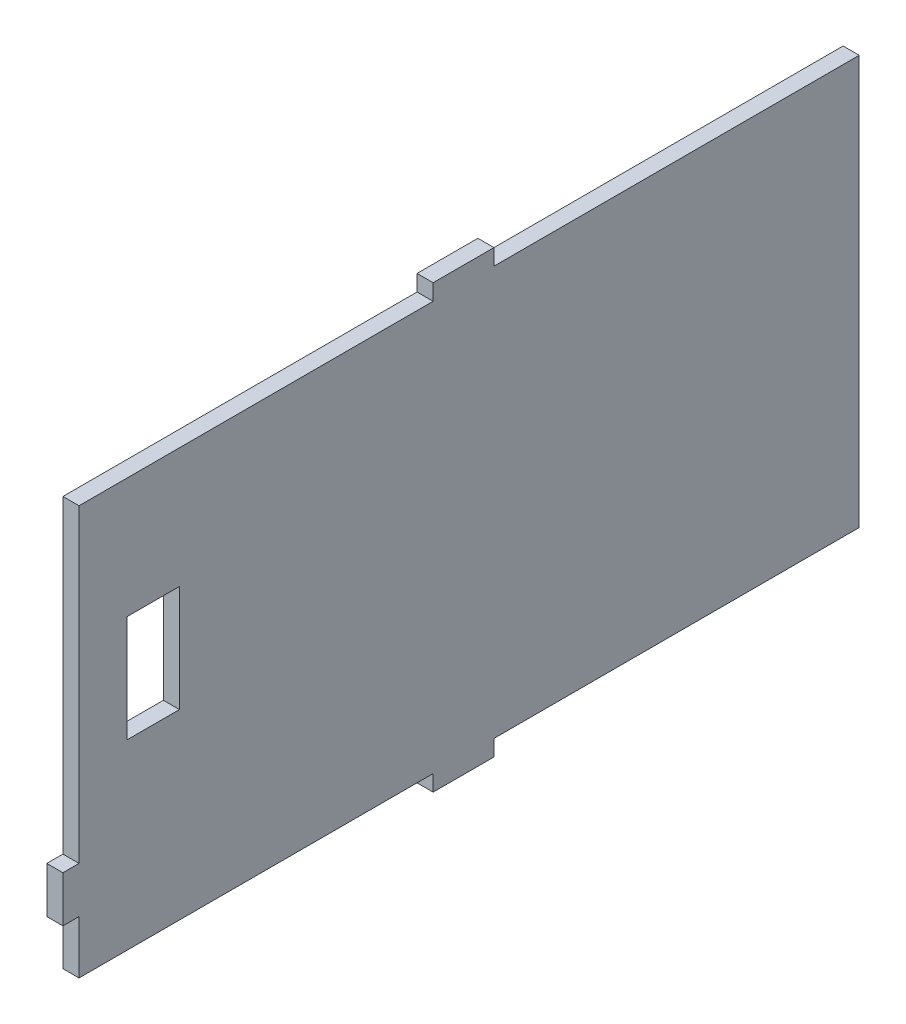
ISO-10303-21;
HEADER;
FILE_DESCRIPTION(('STEP AP214'),'2;1');
FILE_NAME('part.step','',(''),(''),'','','');
FILE_SCHEMA(('AUTOMOTIVE_DESIGN { 1 0 10303 214 1 1 1 1 }'));
ENDSEC;
DATA;
#1=APPLICATION_CONTEXT('core data for automotive mechanical design processes');
#2=APPLICATION_PROTOCOL_DEFINITION('international standard','automotive_design',2000,#1);
#3=PRODUCT_CONTEXT('',#1,'mechanical');
#4=PRODUCT('Part','Part','',(#3));
#5=PRODUCT_RELATED_PRODUCT_CATEGORY('part','',(#4));
#6=PRODUCT_DEFINITION_FORMATION('','',#4);
#7=PRODUCT_DEFINITION_CONTEXT('part definition',#1,'design');
#8=PRODUCT_DEFINITION('design','',#6,#7);
#9=PRODUCT_DEFINITION_SHAPE('','',#8);
#10=(LENGTH_UNIT() NAMED_UNIT(*) SI_UNIT(.MILLI.,.METRE.));
#11=(NAMED_UNIT(*) PLANE_ANGLE_UNIT() SI_UNIT($,.RADIAN.));
#12=(NAMED_UNIT(*) SI_UNIT($,.STERADIAN.) SOLID_ANGLE_UNIT());
#13=UNCERTAINTY_MEASURE_WITH_UNIT(LENGTH_MEASURE(1.E-05),#10,'distance_accuracy_value','');
#14=(GEOMETRIC_REPRESENTATION_CONTEXT(3) GLOBAL_UNCERTAINTY_ASSIGNED_CONTEXT((#13)) GLOBAL_UNIT_ASSIGNED_CONTEXT((#10,
#11,#12)) REPRESENTATION_CONTEXT('',''));
#15=CARTESIAN_POINT('',(0.,0.,0.));
#16=DIRECTION('',(0.,0.,1.));
#17=DIRECTION('',(1.,0.,0.));
#18=AXIS2_PLACEMENT_3D('',#15,#16,#17);
#19=CARTESIAN_POINT('',(-40.1734173991478,-2.50170936649234,90.8543847304114));
#20=DIRECTION('',(0.,0.,1.));
#21=DIRECTION('',(0.,1.,0.));
#22=AXIS2_PLACEMENT_3D('',#19,#20,#21);
#23=PLANE('',#22);
#24=DIRECTION('',(1.,0.,0.));
#25=VECTOR('',#24,1.);
#26=CARTESIAN_POINT('',(3.17500000000002,10.49,90.8543847304114));
#27=LINE('',#26,#25);
#28=CARTESIAN_POINT('',(0.,10.49,90.8543847304114));
#29=VERTEX_POINT('',#28);
#30=CARTESIAN_POINT('',(3.17500000000001,10.49,90.8543847304114));
#31=VERTEX_POINT('',#30);
#32=EDGE_CURVE('E203',#29,#31,#27,.T.);
#33=ORIENTED_EDGE('',*,*,#32,.F.);
#34=DIRECTION('',(0.,-1.,0.));
#35=VECTOR('',#34,1.);
#36=CARTESIAN_POINT('',(0.,80.65,90.8543847304114));
#37=LINE('',#36,#35);
#38=CARTESIAN_POINT('',(0.,0.,90.8543847304114));
#39=VERTEX_POINT('',#38);
#40=EDGE_CURVE('E218',#29,#39,#37,.T.);
#41=ORIENTED_EDGE('',*,*,#40,.T.);
#42=DIRECTION('',(1.,0.,0.));
#43=VECTOR('',#42,1.);
#44=CARTESIAN_POINT('',(3.17500000000001,0.,90.8543847304114));
#45=LINE('',#44,#43);
#46=CARTESIAN_POINT('',(3.17500000000002,0.,90.8543847304114));
#47=VERTEX_POINT('',#46);
#48=EDGE_CURVE('E229',#39,#47,#45,.T.);
#49=ORIENTED_EDGE('',*,*,#48,.T.);
#50=DIRECTION('',(0.,1.,0.));
#51=VECTOR('',#50,1.);
#52=CARTESIAN_POINT('',(3.17500000000001,80.65,90.8543847304114));
#53=LINE('',#52,#51);
#54=EDGE_CURVE('E302',#47,#31,#53,.T.);
#55=ORIENTED_EDGE('',*,*,#54,.T.);
#56=EDGE_LOOP('',(#33,#41,#49,#55));
#57=FACE_BOUND('',#56,.T.);
#58=ADVANCED_FACE('F33',(#57),#23,.T.);
#59=CARTESIAN_POINT('',(3.175,80.65,0.));
#60=DIRECTION('',(0.,-1.,0.));
#61=DIRECTION('',(0.,0.,-1.));
#62=AXIS2_PLACEMENT_3D('',#59,#60,#61);
#63=PLANE('',#62);
#64=DIRECTION('',(0.,0.,1.));
#65=VECTOR('',#64,1.);
#66=CARTESIAN_POINT('',(3.175,80.65,0.));
#67=LINE('',#66,#65);
#68=CARTESIAN_POINT('',(3.175,80.65,21.025));
#69=VERTEX_POINT('',#68);
#70=CARTESIAN_POINT('',(3.17500000000001,80.65,90.8543847304114));
#71=VERTEX_POINT('',#70);
#72=EDGE_CURVE('E300',#69,#71,#67,.T.);
#73=ORIENTED_EDGE('',*,*,#72,.F.);
#74=DIRECTION('',(-1.,0.,0.));
#75=VECTOR('',#74,1.);
#76=CARTESIAN_POINT('',(3.175,80.65,21.025));
#77=LINE('',#76,#75);
#78=CARTESIAN_POINT('',(0.,80.65,21.025));
#79=VERTEX_POINT('',#78);
#80=EDGE_CURVE('E333',#69,#79,#77,.T.);
#81=ORIENTED_EDGE('',*,*,#80,.T.);
#82=DIRECTION('',(0.,0.,1.));
#83=VECTOR('',#82,1.);
#84=CARTESIAN_POINT('',(0.,80.65,0.));
#85=LINE('',#84,#83);
#86=CARTESIAN_POINT('',(0.,80.65,90.8543847304114));
#87=VERTEX_POINT('',#86);
#88=EDGE_CURVE('E455',#79,#87,#85,.T.);
#89=ORIENTED_EDGE('',*,*,#88,.T.);
#90=DIRECTION('',(-1.,0.,0.));
#91=VECTOR('',#90,1.);
#92=CARTESIAN_POINT('',(3.17500000000001,80.65,90.8543847304114));
#93=LINE('',#92,#91);
#94=EDGE_CURVE('E316',#71,#87,#93,.T.);
#95=ORIENTED_EDGE('',*,*,#94,.F.);
#96=EDGE_LOOP('',(#73,#81,#89,#95));
#97=FACE_BOUND('',#96,.T.);
#98=ADVANCED_FACE('F266',(#97),#63,.F.);
#99=CARTESIAN_POINT('',(3.175,0.,0.));
#100=DIRECTION('',(1.,0.,0.));
#101=DIRECTION('',(0.,0.,-1.));
#102=AXIS2_PLACEMENT_3D('',#99,#100,#101);
#103=PLANE('',#102);
#104=DIRECTION('',(0.,1.,0.));
#105=VECTOR('',#104,1.);
#106=CARTESIAN_POINT('',(3.175,56.9724331353427,71.0409240772378));
#107=LINE('',#106,#105);
#108=CARTESIAN_POINT('',(3.175,35.936024987393,71.0409240772378));
#109=VERTEX_POINT('',#108);
#110=CARTESIAN_POINT('',(3.175,56.9724331353427,71.0409240772378));
#111=VERTEX_POINT('',#110);
#112=EDGE_CURVE('E48',#109,#111,#107,.T.);
#113=ORIENTED_EDGE('',*,*,#112,.F.);
#114=DIRECTION('',(0.,0.,-1.));
#115=VECTOR('',#114,1.);
#116=CARTESIAN_POINT('',(3.175,35.936024987393,71.0409240772378));
#117=LINE('',#116,#115);
#118=CARTESIAN_POINT('',(3.175,35.936024987393,81.3578620773683));
#119=VERTEX_POINT('',#118);
#120=EDGE_CURVE('E189',#119,#109,#117,.T.);
#121=ORIENTED_EDGE('',*,*,#120,.F.);
#122=DIRECTION('',(0.,-1.,0.));
#123=VECTOR('',#122,1.);
#124=CARTESIAN_POINT('',(3.175,56.9724331353427,81.3578620773683));
#125=LINE('',#124,#123);
#126=CARTESIAN_POINT('',(3.175,56.9724331353427,81.3578620773683));
#127=VERTEX_POINT('',#126);
#128=EDGE_CURVE('E173',#127,#119,#125,.T.);
#129=ORIENTED_EDGE('',*,*,#128,.F.);
#130=DIRECTION('',(0.,0.,1.));
#131=VECTOR('',#130,1.);
#132=CARTESIAN_POINT('',(3.175,56.9724331353427,71.0409240772378));
#133=LINE('',#132,#131);
#134=EDGE_CURVE('E182',#111,#127,#133,.T.);
#135=ORIENTED_EDGE('',*,*,#134,.F.);
#136=EDGE_LOOP('',(#113,#121,#129,#135));
#137=FACE_BOUND('',#136,.T.);
#138=ORIENTED_EDGE('',*,*,#54,.F.);
#139=DIRECTION('',(0.,0.,1.));
#140=VECTOR('',#139,1.);
#141=CARTESIAN_POINT('',(3.175,0.,0.));
#142=LINE('',#141,#140);
#143=CARTESIAN_POINT('',(3.175,0.,21.025));
#144=VERTEX_POINT('',#143);
#145=EDGE_CURVE('E388',#144,#47,#142,.T.);
#146=ORIENTED_EDGE('',*,*,#145,.F.);
#147=DIRECTION('',(0.,1.,0.));
#148=VECTOR('',#147,1.);
#149=CARTESIAN_POINT('',(3.175,-3.175,21.025));
#150=LINE('',#149,#148);
#151=CARTESIAN_POINT('',(3.175,-3.175,21.025));
#152=VERTEX_POINT('',#151);
#153=EDGE_CURVE('E393',#152,#144,#150,.T.);
#154=ORIENTED_EDGE('',*,*,#153,.F.);
#155=DIRECTION('',(0.,0.,1.));
#156=VECTOR('',#155,1.);
#157=CARTESIAN_POINT('',(3.175,-3.175,21.025));
#158=LINE('',#157,#156);
#159=CARTESIAN_POINT('',(3.175,-3.175,9.02500000000001));
#160=VERTEX_POINT('',#159);
#161=EDGE_CURVE('E374',#160,#152,#158,.T.);
#162=ORIENTED_EDGE('',*,*,#161,.F.);
#163=DIRECTION('',(0.,1.,0.));
#164=VECTOR('',#163,1.);
#165=CARTESIAN_POINT('',(3.175,-3.175,9.02500000000001));
#166=LINE('',#165,#164);
#167=CARTESIAN_POINT('',(3.175,0.,9.02500000000001));
#168=VERTEX_POINT('',#167);
#169=EDGE_CURVE('E364',#160,#168,#166,.T.);
#170=ORIENTED_EDGE('',*,*,#169,.T.);
#171=CARTESIAN_POINT('',(3.175,0.,-63.));
#172=VERTEX_POINT('',#171);
#173=EDGE_CURVE('E244',#172,#168,#142,.T.);
#174=ORIENTED_EDGE('',*,*,#173,.F.);
#175=DIRECTION('',(0.,-1.,0.));
#176=VECTOR('',#175,1.);
#177=CARTESIAN_POINT('',(3.175,80.65,-63.));
#178=LINE('',#177,#176);
#179=CARTESIAN_POINT('',(3.175,80.65,-63.));
#180=VERTEX_POINT('',#179);
#181=EDGE_CURVE('E428',#180,#172,#178,.T.);
#182=ORIENTED_EDGE('',*,*,#181,.F.);
#183=CARTESIAN_POINT('',(3.175,80.65,9.02500000000002));
#184=VERTEX_POINT('',#183);
#185=EDGE_CURVE('E354',#180,#184,#67,.T.);
#186=ORIENTED_EDGE('',*,*,#185,.T.);
#187=DIRECTION('',(0.,-1.,0.));
#188=VECTOR('',#187,1.);
#189=CARTESIAN_POINT('',(3.175,83.825,9.02500000000002));
#190=LINE('',#189,#188);
#191=CARTESIAN_POINT('',(3.175,83.825,9.02500000000002));
#192=VERTEX_POINT('',#191);
#193=EDGE_CURVE('E456',#192,#184,#190,.T.);
#194=ORIENTED_EDGE('',*,*,#193,.F.);
#195=DIRECTION('',(0.,0.,1.));
#196=VECTOR('',#195,1.);
#197=CARTESIAN_POINT('',(3.175,83.825,21.025));
#198=LINE('',#197,#196);
#199=CARTESIAN_POINT('',(3.175,83.825,21.025));
#200=VERTEX_POINT('',#199);
#201=EDGE_CURVE('E337',#192,#200,#198,.T.);
#202=ORIENTED_EDGE('',*,*,#201,.T.);
#203=DIRECTION('',(0.,-1.,0.));
#204=VECTOR('',#203,1.);
#205=CARTESIAN_POINT('',(3.175,83.825,21.025));
#206=LINE('',#205,#204);
#207=EDGE_CURVE('E329',#200,#69,#206,.T.);
#208=ORIENTED_EDGE('',*,*,#207,.T.);
#209=ORIENTED_EDGE('',*,*,#72,.T.);
#210=CARTESIAN_POINT('',(3.17500000000001,19.5727201275267,90.8543847304114));
#211=VERTEX_POINT('',#210);
#212=EDGE_CURVE('E291',#211,#71,#53,.T.);
#213=ORIENTED_EDGE('',*,*,#212,.F.);
#214=DIRECTION('',(0.,0.,-1.));
#215=VECTOR('',#214,1.);
#216=CARTESIAN_POINT('',(3.17500000000002,19.5727201275267,94.0343847304114));
#217=LINE('',#216,#215);
#218=CARTESIAN_POINT('',(3.17500000000002,19.5727201275267,94.0343847304114));
#219=VERTEX_POINT('',#218);
#220=EDGE_CURVE('E223',#219,#211,#217,.T.);
#221=ORIENTED_EDGE('',*,*,#220,.F.);
#222=DIRECTION('',(0.,1.,0.));
#223=VECTOR('',#222,1.);
#224=CARTESIAN_POINT('',(3.17500000000002,10.49,94.0343847304114));
#225=LINE('',#224,#223);
#226=CARTESIAN_POINT('',(3.17500000000002,10.49,94.0343847304114));
#227=VERTEX_POINT('',#226);
#228=EDGE_CURVE('E199',#227,#219,#225,.T.);
#229=ORIENTED_EDGE('',*,*,#228,.F.);
#230=DIRECTION('',(0.,0.,-1.));
#231=VECTOR('',#230,1.);
#232=CARTESIAN_POINT('',(3.17500000000002,10.49,94.0343847304114));
#233=LINE('',#232,#231);
#234=EDGE_CURVE('E209',#227,#31,#233,.T.);
#235=ORIENTED_EDGE('',*,*,#234,.T.);
#236=EDGE_LOOP('',(#138,#146,#154,#162,#170,#174,#182,#186,#194,#202,#208,#209,#213,#221,#229,#235));
#237=FACE_BOUND('',#236,.T.);
#238=ADVANCED_FACE('F186',(#137,#237),#103,.T.);
#239=CARTESIAN_POINT('',(0.,0.,0.));
#240=DIRECTION('',(1.,0.,0.));
#241=DIRECTION('',(0.,0.,-1.));
#242=AXIS2_PLACEMENT_3D('',#239,#240,#241);
#243=PLANE('',#242);
#244=DIRECTION('',(0.,0.,-1.));
#245=VECTOR('',#244,1.);
#246=CARTESIAN_POINT('',(0.,35.936024987393,0.));
#247=LINE('',#246,#245);
#248=CARTESIAN_POINT('',(0.,35.936024987393,81.3578620773683));
#249=VERTEX_POINT('',#248);
#250=CARTESIAN_POINT('',(0.,35.936024987393,71.0409240772378));
#251=VERTEX_POINT('',#250);
#252=EDGE_CURVE('E41',#249,#251,#247,.T.);
#253=ORIENTED_EDGE('',*,*,#252,.T.);
#254=DIRECTION('',(0.,1.,0.));
#255=VECTOR('',#254,1.);
#256=CARTESIAN_POINT('',(0.,0.,71.0409240772378));
#257=LINE('',#256,#255);
#258=CARTESIAN_POINT('',(0.,56.9724331353427,71.0409240772378));
#259=VERTEX_POINT('',#258);
#260=EDGE_CURVE('E11',#251,#259,#257,.T.);
#261=ORIENTED_EDGE('',*,*,#260,.T.);
#262=DIRECTION('',(0.,0.,1.));
#263=VECTOR('',#262,1.);
#264=CARTESIAN_POINT('',(0.,56.9724331353427,0.));
#265=LINE('',#264,#263);
#266=CARTESIAN_POINT('',(0.,56.9724331353427,81.3578620773683));
#267=VERTEX_POINT('',#266);
#268=EDGE_CURVE('E242',#259,#267,#265,.T.);
#269=ORIENTED_EDGE('',*,*,#268,.T.);
#270=DIRECTION('',(0.,-1.,0.));
#271=VECTOR('',#270,1.);
#272=CARTESIAN_POINT('',(0.,0.,81.3578620773683));
#273=LINE('',#272,#271);
#274=EDGE_CURVE('E176',#267,#249,#273,.T.);
#275=ORIENTED_EDGE('',*,*,#274,.T.);
#276=EDGE_LOOP('',(#253,#261,#269,#275));
#277=FACE_BOUND('',#276,.T.);
#278=DIRECTION('',(0.,0.,1.));
#279=VECTOR('',#278,1.);
#280=CARTESIAN_POINT('',(0.,0.,0.));
#281=LINE('',#280,#279);
#282=CARTESIAN_POINT('',(0.,0.,21.025));
#283=VERTEX_POINT('',#282);
#284=EDGE_CURVE('E314',#283,#39,#281,.T.);
#285=ORIENTED_EDGE('',*,*,#284,.T.);
#286=ORIENTED_EDGE('',*,*,#40,.F.);
#287=DIRECTION('',(0.,0.,-1.));
#288=VECTOR('',#287,1.);
#289=CARTESIAN_POINT('',(0.,10.49,94.0343847304114));
#290=LINE('',#289,#288);
#291=CARTESIAN_POINT('',(0.,10.49,94.0343847304114));
#292=VERTEX_POINT('',#291);
#293=EDGE_CURVE('E224',#292,#29,#290,.T.);
#294=ORIENTED_EDGE('',*,*,#293,.F.);
#295=DIRECTION('',(0.,-1.,0.));
#296=VECTOR('',#295,1.);
#297=CARTESIAN_POINT('',(0.,10.49,94.0343847304114));
#298=LINE('',#297,#296);
#299=CARTESIAN_POINT('',(0.,19.5727201275267,94.0343847304114));
#300=VERTEX_POINT('',#299);
#301=EDGE_CURVE('E205',#300,#292,#298,.T.);
#302=ORIENTED_EDGE('',*,*,#301,.F.);
#303=DIRECTION('',(0.,0.,-1.));
#304=VECTOR('',#303,1.);
#305=CARTESIAN_POINT('',(0.,19.5727201275267,94.0343847304114));
#306=LINE('',#305,#304);
#307=CARTESIAN_POINT('',(0.,19.5727201275267,90.8543847304114));
#308=VERTEX_POINT('',#307);
#309=EDGE_CURVE('E220',#300,#308,#306,.T.);
#310=ORIENTED_EDGE('',*,*,#309,.T.);
#311=EDGE_CURVE('E294',#87,#308,#37,.T.);
#312=ORIENTED_EDGE('',*,*,#311,.F.);
#313=ORIENTED_EDGE('',*,*,#88,.F.);
#314=DIRECTION('',(0.,-1.,0.));
#315=VECTOR('',#314,1.);
#316=CARTESIAN_POINT('',(0.,83.825,21.025));
#317=LINE('',#316,#315);
#318=CARTESIAN_POINT('',(0.,83.825,21.025));
#319=VERTEX_POINT('',#318);
#320=EDGE_CURVE('E331',#319,#79,#317,.T.);
#321=ORIENTED_EDGE('',*,*,#320,.F.);
#322=DIRECTION('',(0.,0.,-1.));
#323=VECTOR('',#322,1.);
#324=CARTESIAN_POINT('',(0.,83.825,21.025));
#325=LINE('',#324,#323);
#326=CARTESIAN_POINT('',(0.,83.825,9.02500000000002));
#327=VERTEX_POINT('',#326);
#328=EDGE_CURVE('E441',#319,#327,#325,.T.);
#329=ORIENTED_EDGE('',*,*,#328,.T.);
#330=DIRECTION('',(0.,-1.,0.));
#331=VECTOR('',#330,1.);
#332=CARTESIAN_POINT('',(0.,83.825,9.02500000000002));
#333=LINE('',#332,#331);
#334=CARTESIAN_POINT('',(0.,80.65,9.02500000000002));
#335=VERTEX_POINT('',#334);
#336=EDGE_CURVE('E452',#327,#335,#333,.T.);
#337=ORIENTED_EDGE('',*,*,#336,.T.);
#338=CARTESIAN_POINT('',(0.,80.65,-63.));
#339=VERTEX_POINT('',#338);
#340=EDGE_CURVE('E464',#339,#335,#85,.T.);
#341=ORIENTED_EDGE('',*,*,#340,.F.);
#342=DIRECTION('',(0.,1.,0.));
#343=VECTOR('',#342,1.);
#344=CARTESIAN_POINT('',(0.,80.65,-63.));
#345=LINE('',#344,#343);
#346=CARTESIAN_POINT('',(0.,0.,-63.));
#347=VERTEX_POINT('',#346);
#348=EDGE_CURVE('E317',#347,#339,#345,.T.);
#349=ORIENTED_EDGE('',*,*,#348,.F.);
#350=CARTESIAN_POINT('',(0.,0.,9.02500000000001));
#351=VERTEX_POINT('',#350);
#352=EDGE_CURVE('E392',#347,#351,#281,.T.);
#353=ORIENTED_EDGE('',*,*,#352,.T.);
#354=DIRECTION('',(0.,1.,0.));
#355=VECTOR('',#354,1.);
#356=CARTESIAN_POINT('',(0.,-3.175,9.02500000000001));
#357=LINE('',#356,#355);
#358=CARTESIAN_POINT('',(0.,-3.175,9.02500000000001));
#359=VERTEX_POINT('',#358);
#360=EDGE_CURVE('E360',#359,#351,#357,.T.);
#361=ORIENTED_EDGE('',*,*,#360,.F.);
#362=DIRECTION('',(0.,0.,-1.));
#363=VECTOR('',#362,1.);
#364=CARTESIAN_POINT('',(0.,-3.175,21.025));
#365=LINE('',#364,#363);
#366=CARTESIAN_POINT('',(0.,-3.175,21.025));
#367=VERTEX_POINT('',#366);
#368=EDGE_CURVE('E411',#367,#359,#365,.T.);
#369=ORIENTED_EDGE('',*,*,#368,.F.);
#370=DIRECTION('',(0.,1.,0.));
#371=VECTOR('',#370,1.);
#372=CARTESIAN_POINT('',(0.,-3.175,21.025));
#373=LINE('',#372,#371);
#374=EDGE_CURVE('E363',#367,#283,#373,.T.);
#375=ORIENTED_EDGE('',*,*,#374,.T.);
#376=EDGE_LOOP('',(#285,#286,#294,#302,#310,#312,#313,#321,#329,#337,#341,#349,#353,#361,#369,#375));
#377=FACE_BOUND('',#376,.T.);
#378=ADVANCED_FACE('F247',(#277,#377),#243,.F.);
#379=ORIENTED_EDGE('',*,*,#340,.T.);
#380=DIRECTION('',(1.,0.,0.));
#381=VECTOR('',#380,1.);
#382=CARTESIAN_POINT('',(3.175,80.65,9.02500000000002));
#383=LINE('',#382,#381);
#384=EDGE_CURVE('E338',#335,#184,#383,.T.);
#385=ORIENTED_EDGE('',*,*,#384,.T.);
#386=ORIENTED_EDGE('',*,*,#185,.F.);
#387=DIRECTION('',(1.,0.,0.));
#388=VECTOR('',#387,1.);
#389=CARTESIAN_POINT('',(0.,80.65,-63.));
#390=LINE('',#389,#388);
#391=EDGE_CURVE('E432',#339,#180,#390,.T.);
#392=ORIENTED_EDGE('',*,*,#391,.F.);
#393=EDGE_LOOP('',(#379,#385,#386,#392));
#394=FACE_BOUND('',#393,.T.);
#395=ADVANCED_FACE('F275',(#394),#63,.F.);
#396=CARTESIAN_POINT('',(3.175,0.,0.));
#397=DIRECTION('',(0.,-1.,0.));
#398=DIRECTION('',(0.,0.,-1.));
#399=AXIS2_PLACEMENT_3D('',#396,#397,#398);
#400=PLANE('',#399);
#401=DIRECTION('',(1.,0.,0.));
#402=VECTOR('',#401,1.);
#403=CARTESIAN_POINT('',(3.175,0.,9.02500000000001));
#404=LINE('',#403,#402);
#405=EDGE_CURVE('E370',#351,#168,#404,.T.);
#406=ORIENTED_EDGE('',*,*,#405,.F.);
#407=ORIENTED_EDGE('',*,*,#352,.F.);
#408=DIRECTION('',(-1.,0.,0.));
#409=VECTOR('',#408,1.);
#410=CARTESIAN_POINT('',(0.,0.,-63.));
#411=LINE('',#410,#409);
#412=EDGE_CURVE('E426',#172,#347,#411,.T.);
#413=ORIENTED_EDGE('',*,*,#412,.F.);
#414=ORIENTED_EDGE('',*,*,#173,.T.);
#415=EDGE_LOOP('',(#406,#407,#413,#414));
#416=FACE_BOUND('',#415,.T.);
#417=ADVANCED_FACE('F423',(#416),#400,.T.);
#418=DIRECTION('',(-1.,0.,0.));
#419=VECTOR('',#418,1.);
#420=CARTESIAN_POINT('',(3.175,0.,21.025));
#421=LINE('',#420,#419);
#422=EDGE_CURVE('E357',#144,#283,#421,.T.);
#423=ORIENTED_EDGE('',*,*,#422,.F.);
#424=ORIENTED_EDGE('',*,*,#145,.T.);
#425=ORIENTED_EDGE('',*,*,#48,.F.);
#426=ORIENTED_EDGE('',*,*,#284,.F.);
#427=EDGE_LOOP('',(#423,#424,#425,#426));
#428=FACE_BOUND('',#427,.T.);
#429=ADVANCED_FACE('F35',(#428),#400,.T.);
#430=CARTESIAN_POINT('',(3.175,-3.175,21.025));
#431=DIRECTION('',(0.,0.,-1.));
#432=DIRECTION('',(0.,1.,0.));
#433=AXIS2_PLACEMENT_3D('',#430,#431,#432);
#434=PLANE('',#433);
#435=ORIENTED_EDGE('',*,*,#422,.T.);
#436=ORIENTED_EDGE('',*,*,#374,.F.);
#437=DIRECTION('',(-1.,0.,0.));
#438=VECTOR('',#437,1.);
#439=CARTESIAN_POINT('',(3.175,-3.175,21.025));
#440=LINE('',#439,#438);
#441=EDGE_CURVE('E405',#152,#367,#440,.T.);
#442=ORIENTED_EDGE('',*,*,#441,.F.);
#443=ORIENTED_EDGE('',*,*,#153,.T.);
#444=EDGE_LOOP('',(#435,#436,#442,#443));
#445=FACE_BOUND('',#444,.T.);
#446=ADVANCED_FACE('F403',(#445),#434,.F.);
#447=CARTESIAN_POINT('',(3.175,-3.175,9.02500000000001));
#448=DIRECTION('',(0.,0.,1.));
#449=DIRECTION('',(0.,-1.,0.));
#450=AXIS2_PLACEMENT_3D('',#447,#448,#449);
#451=PLANE('',#450);
#452=ORIENTED_EDGE('',*,*,#405,.T.);
#453=ORIENTED_EDGE('',*,*,#169,.F.);
#454=DIRECTION('',(1.,0.,0.));
#455=VECTOR('',#454,1.);
#456=CARTESIAN_POINT('',(3.175,-3.175,9.02500000000001));
#457=LINE('',#456,#455);
#458=EDGE_CURVE('E369',#359,#160,#457,.T.);
#459=ORIENTED_EDGE('',*,*,#458,.F.);
#460=ORIENTED_EDGE('',*,*,#360,.T.);
#461=EDGE_LOOP('',(#452,#453,#459,#460));
#462=FACE_BOUND('',#461,.T.);
#463=ADVANCED_FACE('F421',(#462),#451,.F.);
#464=CARTESIAN_POINT('',(0.,-3.175,0.));
#465=DIRECTION('',(0.,1.,0.));
#466=DIRECTION('',(0.,0.,1.));
#467=AXIS2_PLACEMENT_3D('',#464,#465,#466);
#468=PLANE('',#467);
#469=ORIENTED_EDGE('',*,*,#161,.T.);
#470=ORIENTED_EDGE('',*,*,#441,.T.);
#471=ORIENTED_EDGE('',*,*,#368,.T.);
#472=ORIENTED_EDGE('',*,*,#458,.T.);
#473=EDGE_LOOP('',(#469,#470,#471,#472));
#474=FACE_BOUND('',#473,.T.);
#475=ADVANCED_FACE('F416',(#474),#468,.F.);
#476=CARTESIAN_POINT('',(3.175,83.825,9.02500000000002));
#477=DIRECTION('',(0.,0.,-1.));
#478=DIRECTION('',(0.,1.,0.));
#479=AXIS2_PLACEMENT_3D('',#476,#477,#478);
#480=PLANE('',#479);
#481=ORIENTED_EDGE('',*,*,#384,.F.);
#482=ORIENTED_EDGE('',*,*,#336,.F.);
#483=DIRECTION('',(1.,0.,0.));
#484=VECTOR('',#483,1.);
#485=CARTESIAN_POINT('',(3.175,83.825,9.02500000000002));
#486=LINE('',#485,#484);
#487=EDGE_CURVE('E438',#327,#192,#486,.T.);
#488=ORIENTED_EDGE('',*,*,#487,.T.);
#489=ORIENTED_EDGE('',*,*,#193,.T.);
#490=EDGE_LOOP('',(#481,#482,#488,#489));
#491=FACE_BOUND('',#490,.T.);
#492=ADVANCED_FACE('F470',(#491),#480,.T.);
#493=CARTESIAN_POINT('',(3.175,83.825,21.025));
#494=DIRECTION('',(0.,0.,1.));
#495=DIRECTION('',(0.,-1.,0.));
#496=AXIS2_PLACEMENT_3D('',#493,#494,#495);
#497=PLANE('',#496);
#498=ORIENTED_EDGE('',*,*,#80,.F.);
#499=ORIENTED_EDGE('',*,*,#207,.F.);
#500=DIRECTION('',(-1.,0.,0.));
#501=VECTOR('',#500,1.);
#502=CARTESIAN_POINT('',(3.175,83.825,21.025));
#503=LINE('',#502,#501);
#504=EDGE_CURVE('E332',#200,#319,#503,.T.);
#505=ORIENTED_EDGE('',*,*,#504,.T.);
#506=ORIENTED_EDGE('',*,*,#320,.T.);
#507=EDGE_LOOP('',(#498,#499,#505,#506));
#508=FACE_BOUND('',#507,.T.);
#509=ADVANCED_FACE('F447',(#508),#497,.T.);
#510=CARTESIAN_POINT('',(0.,83.825,0.));
#511=DIRECTION('',(0.,-1.,0.));
#512=DIRECTION('',(0.,0.,1.));
#513=AXIS2_PLACEMENT_3D('',#510,#511,#512);
#514=PLANE('',#513);
#515=ORIENTED_EDGE('',*,*,#201,.F.);
#516=ORIENTED_EDGE('',*,*,#487,.F.);
#517=ORIENTED_EDGE('',*,*,#328,.F.);
#518=ORIENTED_EDGE('',*,*,#504,.F.);
#519=EDGE_LOOP('',(#515,#516,#517,#518));
#520=FACE_BOUND('',#519,.T.);
#521=ADVANCED_FACE('F287',(#520),#514,.F.);
#522=CARTESIAN_POINT('',(0.,0.,-63.));
#523=DIRECTION('',(0.,0.,1.));
#524=DIRECTION('',(1.,0.,0.));
#525=AXIS2_PLACEMENT_3D('',#522,#523,#524);
#526=PLANE('',#525);
#527=ORIENTED_EDGE('',*,*,#348,.T.);
#528=ORIENTED_EDGE('',*,*,#391,.T.);
#529=ORIENTED_EDGE('',*,*,#181,.T.);
#530=ORIENTED_EDGE('',*,*,#412,.T.);
#531=EDGE_LOOP('',(#527,#528,#529,#530));
#532=FACE_BOUND('',#531,.T.);
#533=ADVANCED_FACE('F280',(#532),#526,.F.);
#534=DIRECTION('',(-1.,0.,0.));
#535=VECTOR('',#534,1.);
#536=CARTESIAN_POINT('',(3.17500000000002,19.5727201275267,90.8543847304114));
#537=LINE('',#536,#535);
#538=EDGE_CURVE('E196',#211,#308,#537,.T.);
#539=ORIENTED_EDGE('',*,*,#538,.F.);
#540=ORIENTED_EDGE('',*,*,#212,.T.);
#541=ORIENTED_EDGE('',*,*,#94,.T.);
#542=ORIENTED_EDGE('',*,*,#311,.T.);
#543=EDGE_LOOP('',(#539,#540,#541,#542));
#544=FACE_BOUND('',#543,.T.);
#545=ADVANCED_FACE('F269',(#544),#23,.T.);
#546=CARTESIAN_POINT('',(3.17500000000002,19.5727201275267,94.0343847304114));
#547=DIRECTION('',(0.,-1.,0.));
#548=DIRECTION('',(0.,0.,-1.));
#549=AXIS2_PLACEMENT_3D('',#546,#547,#548);
#550=PLANE('',#549);
#551=ORIENTED_EDGE('',*,*,#538,.T.);
#552=ORIENTED_EDGE('',*,*,#309,.F.);
#553=DIRECTION('',(-1.,0.,0.));
#554=VECTOR('',#553,1.);
#555=CARTESIAN_POINT('',(3.17500000000002,19.5727201275267,94.0343847304114));
#556=LINE('',#555,#554);
#557=EDGE_CURVE('E202',#219,#300,#556,.T.);
#558=ORIENTED_EDGE('',*,*,#557,.F.);
#559=ORIENTED_EDGE('',*,*,#220,.T.);
#560=EDGE_LOOP('',(#551,#552,#558,#559));
#561=FACE_BOUND('',#560,.T.);
#562=ADVANCED_FACE('F279',(#561),#550,.F.);
#563=CARTESIAN_POINT('',(3.17500000000002,10.49,94.0343847304114));
#564=DIRECTION('',(0.,1.,0.));
#565=DIRECTION('',(0.,0.,1.));
#566=AXIS2_PLACEMENT_3D('',#563,#564,#565);
#567=PLANE('',#566);
#568=ORIENTED_EDGE('',*,*,#32,.T.);
#569=ORIENTED_EDGE('',*,*,#234,.F.);
#570=DIRECTION('',(1.,0.,0.));
#571=VECTOR('',#570,1.);
#572=CARTESIAN_POINT('',(3.17500000000002,10.49,94.0343847304114));
#573=LINE('',#572,#571);
#574=EDGE_CURVE('E207',#292,#227,#573,.T.);
#575=ORIENTED_EDGE('',*,*,#574,.F.);
#576=ORIENTED_EDGE('',*,*,#293,.T.);
#577=EDGE_LOOP('',(#568,#569,#575,#576));
#578=FACE_BOUND('',#577,.T.);
#579=ADVANCED_FACE('F261',(#578),#567,.F.);
#580=CARTESIAN_POINT('',(0.,0.,94.0343847304114));
#581=DIRECTION('',(0.,0.,1.));
#582=DIRECTION('',(1.,0.,0.));
#583=AXIS2_PLACEMENT_3D('',#580,#581,#582);
#584=PLANE('',#583);
#585=ORIENTED_EDGE('',*,*,#228,.T.);
#586=ORIENTED_EDGE('',*,*,#557,.T.);
#587=ORIENTED_EDGE('',*,*,#301,.T.);
#588=ORIENTED_EDGE('',*,*,#574,.T.);
#589=EDGE_LOOP('',(#585,#586,#587,#588));
#590=FACE_BOUND('',#589,.T.);
#591=ADVANCED_FACE('F254',(#590),#584,.T.);
#592=CARTESIAN_POINT('',(-0.00500000000000023,56.9724331353427,71.0409240772378));
#593=DIRECTION('',(0.,0.,-1.));
#594=DIRECTION('',(-1.,0.,0.));
#595=AXIS2_PLACEMENT_3D('',#592,#593,#594);
#596=PLANE('',#595);
#597=DIRECTION('',(1.,0.,0.));
#598=VECTOR('',#597,1.);
#599=CARTESIAN_POINT('',(-0.00500000000000023,35.936024987393,71.0409240772378));
#600=LINE('',#599,#598);
#601=EDGE_CURVE('E194',#251,#109,#600,.T.);
#602=ORIENTED_EDGE('',*,*,#601,.T.);
#603=ORIENTED_EDGE('',*,*,#112,.T.);
#604=DIRECTION('',(1.,0.,0.));
#605=VECTOR('',#604,1.);
#606=CARTESIAN_POINT('',(-0.00500000000000023,56.9724331353427,71.0409240772378));
#607=LINE('',#606,#605);
#608=EDGE_CURVE('E179',#259,#111,#607,.T.);
#609=ORIENTED_EDGE('',*,*,#608,.F.);
#610=ORIENTED_EDGE('',*,*,#260,.F.);
#611=EDGE_LOOP('',(#602,#603,#609,#610));
#612=FACE_BOUND('',#611,.T.);
#613=ADVANCED_FACE('F252',(#612),#596,.F.);
#614=CARTESIAN_POINT('',(-0.00500000000000023,35.936024987393,71.0409240772378));
#615=DIRECTION('',(0.,-1.,0.));
#616=DIRECTION('',(0.,0.,-1.));
#617=AXIS2_PLACEMENT_3D('',#614,#615,#616);
#618=PLANE('',#617);
#619=DIRECTION('',(1.,0.,0.));
#620=VECTOR('',#619,1.);
#621=CARTESIAN_POINT('',(-0.00500000000000023,35.936024987393,81.3578620773683));
#622=LINE('',#621,#620);
#623=EDGE_CURVE('E178',#249,#119,#622,.T.);
#624=ORIENTED_EDGE('',*,*,#623,.T.);
#625=ORIENTED_EDGE('',*,*,#120,.T.);
#626=ORIENTED_EDGE('',*,*,#601,.F.);
#627=ORIENTED_EDGE('',*,*,#252,.F.);
#628=EDGE_LOOP('',(#624,#625,#626,#627));
#629=FACE_BOUND('',#628,.T.);
#630=ADVANCED_FACE('F251',(#629),#618,.F.);
#631=CARTESIAN_POINT('',(-0.00500000000000023,56.9724331353427,81.3578620773683));
#632=DIRECTION('',(0.,0.,1.));
#633=DIRECTION('',(1.,0.,0.));
#634=AXIS2_PLACEMENT_3D('',#631,#632,#633);
#635=PLANE('',#634);
#636=DIRECTION('',(1.,0.,0.));
#637=VECTOR('',#636,1.);
#638=CARTESIAN_POINT('',(-0.00500000000000023,56.9724331353427,81.3578620773683));
#639=LINE('',#638,#637);
#640=EDGE_CURVE('E56',#267,#127,#639,.T.);
#641=ORIENTED_EDGE('',*,*,#640,.T.);
#642=ORIENTED_EDGE('',*,*,#128,.T.);
#643=ORIENTED_EDGE('',*,*,#623,.F.);
#644=ORIENTED_EDGE('',*,*,#274,.F.);
#645=EDGE_LOOP('',(#641,#642,#643,#644));
#646=FACE_BOUND('',#645,.T.);
#647=ADVANCED_FACE('F170',(#646),#635,.F.);
#648=CARTESIAN_POINT('',(-0.00500000000000023,56.9724331353427,71.0409240772378));
#649=DIRECTION('',(0.,1.,0.));
#650=DIRECTION('',(0.,0.,1.));
#651=AXIS2_PLACEMENT_3D('',#648,#649,#650);
#652=PLANE('',#651);
#653=ORIENTED_EDGE('',*,*,#608,.T.);
#654=ORIENTED_EDGE('',*,*,#134,.T.);
#655=ORIENTED_EDGE('',*,*,#640,.F.);
#656=ORIENTED_EDGE('',*,*,#268,.F.);
#657=EDGE_LOOP('',(#653,#654,#655,#656));
#658=FACE_BOUND('',#657,.T.);
#659=ADVANCED_FACE('F183',(#658),#652,.F.);
#660=CLOSED_SHELL('',(#58,#98,#238,#378,#395,#417,#429,#446,#463,#475,#492,#509,#521,#533,#545,
#562,#579,#591,#613,#630,#647,#659));
#661=MANIFOLD_SOLID_BREP('B2',#660);
#662=ADVANCED_BREP_SHAPE_REPRESENTATION('',(#18,#661),#14);
#663=SHAPE_DEFINITION_REPRESENTATION(#9,#662);
ENDSEC;
END-ISO-10303-21;
